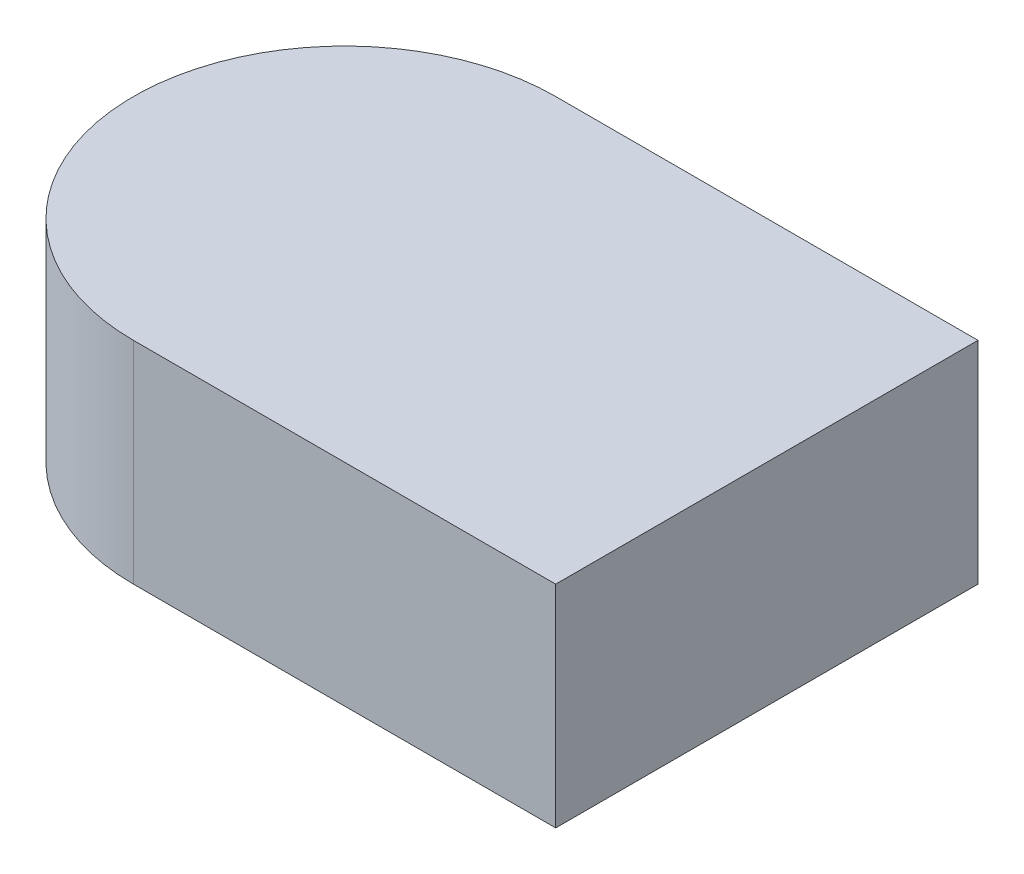
ISO-10303-21;
HEADER;
FILE_DESCRIPTION(('STEP AP214'),'2;1');
FILE_NAME('part.step','',(''),(''),'','','');
FILE_SCHEMA(('AUTOMOTIVE_DESIGN { 1 0 10303 214 1 1 1 1 }'));
ENDSEC;
DATA;
#1=APPLICATION_CONTEXT('core data for automotive mechanical design processes');
#2=APPLICATION_PROTOCOL_DEFINITION('international standard','automotive_design',2000,#1);
#3=PRODUCT_CONTEXT('',#1,'mechanical');
#4=PRODUCT('Part','Part','',(#3));
#5=PRODUCT_RELATED_PRODUCT_CATEGORY('part','',(#4));
#6=PRODUCT_DEFINITION_FORMATION('','',#4);
#7=PRODUCT_DEFINITION_CONTEXT('part definition',#1,'design');
#8=PRODUCT_DEFINITION('design','',#6,#7);
#9=PRODUCT_DEFINITION_SHAPE('','',#8);
#10=(LENGTH_UNIT() NAMED_UNIT(*) SI_UNIT(.MILLI.,.METRE.));
#11=(NAMED_UNIT(*) PLANE_ANGLE_UNIT() SI_UNIT($,.RADIAN.));
#12=(NAMED_UNIT(*) SI_UNIT($,.STERADIAN.) SOLID_ANGLE_UNIT());
#13=UNCERTAINTY_MEASURE_WITH_UNIT(LENGTH_MEASURE(1.E-05),#10,'distance_accuracy_value','');
#14=(GEOMETRIC_REPRESENTATION_CONTEXT(3) GLOBAL_UNCERTAINTY_ASSIGNED_CONTEXT((#13)) GLOBAL_UNIT_ASSIGNED_CONTEXT((#10,
#11,#12)) REPRESENTATION_CONTEXT('',''));
#15=CARTESIAN_POINT('',(0.,0.,0.));
#16=DIRECTION('',(0.,0.,1.));
#17=DIRECTION('',(1.,0.,0.));
#18=AXIS2_PLACEMENT_3D('',#15,#16,#17);
#19=CARTESIAN_POINT('',(0.,0.,0.));
#20=DIRECTION('',(0.,1.,0.));
#21=DIRECTION('',(1.,0.,0.));
#22=AXIS2_PLACEMENT_3D('',#19,#20,#21);
#23=PLANE('',#22);
#24=DIRECTION('',(0.,0.,-1.));
#25=VECTOR('',#24,1.);
#26=CARTESIAN_POINT('',(1.25,0.,1.5));
#27=LINE('',#26,#25);
#28=CARTESIAN_POINT('',(1.25,0.,1.5));
#29=VERTEX_POINT('',#28);
#30=CARTESIAN_POINT('',(1.25,0.,1.3));
#31=VERTEX_POINT('',#30);
#32=EDGE_CURVE('E11',#29,#31,#27,.T.);
#33=ORIENTED_EDGE('',*,*,#32,.F.);
#34=DIRECTION('',(1.,0.,0.));
#35=VECTOR('',#34,1.);
#36=CARTESIAN_POINT('',(1.05,0.,1.5));
#37=LINE('',#36,#35);
#38=CARTESIAN_POINT('',(1.05,0.,1.5));
#39=VERTEX_POINT('',#38);
#40=EDGE_CURVE('E25',#39,#29,#37,.T.);
#41=ORIENTED_EDGE('',*,*,#40,.F.);
#42=CARTESIAN_POINT('',(1.05,0.,1.4));
#43=DIRECTION('',(0.,1.,0.));
#44=DIRECTION('',(0.,0.,-1.));
#45=AXIS2_PLACEMENT_3D('',#42,#43,#44);
#46=CIRCLE('',#45,0.1);
#47=CARTESIAN_POINT('',(1.05,0.,1.3));
#48=VERTEX_POINT('',#47);
#49=EDGE_CURVE('E73',#48,#39,#46,.T.);
#50=ORIENTED_EDGE('',*,*,#49,.F.);
#51=DIRECTION('',(-1.,0.,0.));
#52=VECTOR('',#51,1.);
#53=CARTESIAN_POINT('',(1.25,0.,1.3));
#54=LINE('',#53,#52);
#55=EDGE_CURVE('E99',#31,#48,#54,.T.);
#56=ORIENTED_EDGE('',*,*,#55,.F.);
#57=EDGE_LOOP('',(#33,#41,#50,#56));
#58=FACE_BOUND('',#57,.T.);
#59=ADVANCED_FACE('F17',(#58),#23,.F.);
#60=CARTESIAN_POINT('',(1.25,0.,1.3));
#61=DIRECTION('',(0.,0.,-1.));
#62=DIRECTION('',(-1.,0.,0.));
#63=AXIS2_PLACEMENT_3D('',#60,#61,#62);
#64=PLANE('',#63);
#65=DIRECTION('',(0.,1.,0.));
#66=VECTOR('',#65,1.);
#67=CARTESIAN_POINT('',(1.05,0.,1.3));
#68=LINE('',#67,#66);
#69=CARTESIAN_POINT('',(1.05,0.1,1.3));
#70=VERTEX_POINT('',#69);
#71=EDGE_CURVE('E95',#48,#70,#68,.T.);
#72=ORIENTED_EDGE('',*,*,#71,.T.);
#73=DIRECTION('',(-1.,0.,0.));
#74=VECTOR('',#73,1.);
#75=CARTESIAN_POINT('',(1.25,0.1,1.3));
#76=LINE('',#75,#74);
#77=CARTESIAN_POINT('',(1.25,0.1,1.3));
#78=VERTEX_POINT('',#77);
#79=EDGE_CURVE('E68',#78,#70,#76,.T.);
#80=ORIENTED_EDGE('',*,*,#79,.F.);
#81=DIRECTION('',(0.,1.,0.));
#82=VECTOR('',#81,1.);
#83=CARTESIAN_POINT('',(1.25,0.,1.3));
#84=LINE('',#83,#82);
#85=EDGE_CURVE('E87',#31,#78,#84,.T.);
#86=ORIENTED_EDGE('',*,*,#85,.F.);
#87=ORIENTED_EDGE('',*,*,#55,.T.);
#88=EDGE_LOOP('',(#72,#80,#86,#87));
#89=FACE_BOUND('',#88,.T.);
#90=ADVANCED_FACE('F113',(#89),#64,.T.);
#91=CARTESIAN_POINT('',(1.25,0.,1.5));
#92=DIRECTION('',(1.,0.,0.));
#93=DIRECTION('',(0.,0.,-1.));
#94=AXIS2_PLACEMENT_3D('',#91,#92,#93);
#95=PLANE('',#94);
#96=ORIENTED_EDGE('',*,*,#85,.T.);
#97=DIRECTION('',(0.,0.,-1.));
#98=VECTOR('',#97,1.);
#99=CARTESIAN_POINT('',(1.25,0.1,1.5));
#100=LINE('',#99,#98);
#101=CARTESIAN_POINT('',(1.25,0.1,1.5));
#102=VERTEX_POINT('',#101);
#103=EDGE_CURVE('E83',#102,#78,#100,.T.);
#104=ORIENTED_EDGE('',*,*,#103,.F.);
#105=DIRECTION('',(0.,1.,0.));
#106=VECTOR('',#105,1.);
#107=CARTESIAN_POINT('',(1.25,0.,1.5));
#108=LINE('',#107,#106);
#109=EDGE_CURVE('E60',#29,#102,#108,.T.);
#110=ORIENTED_EDGE('',*,*,#109,.F.);
#111=ORIENTED_EDGE('',*,*,#32,.T.);
#112=EDGE_LOOP('',(#96,#104,#110,#111));
#113=FACE_BOUND('',#112,.T.);
#114=ADVANCED_FACE('F119',(#113),#95,.T.);
#115=CARTESIAN_POINT('',(1.05,0.,1.5));
#116=DIRECTION('',(0.,0.,1.));
#117=DIRECTION('',(1.,0.,0.));
#118=AXIS2_PLACEMENT_3D('',#115,#116,#117);
#119=PLANE('',#118);
#120=ORIENTED_EDGE('',*,*,#109,.T.);
#121=DIRECTION('',(1.,0.,0.));
#122=VECTOR('',#121,1.);
#123=CARTESIAN_POINT('',(1.05,0.1,1.5));
#124=LINE('',#123,#122);
#125=CARTESIAN_POINT('',(1.05,0.1,1.5));
#126=VERTEX_POINT('',#125);
#127=EDGE_CURVE('E54',#126,#102,#124,.T.);
#128=ORIENTED_EDGE('',*,*,#127,.F.);
#129=DIRECTION('',(0.,1.,0.));
#130=VECTOR('',#129,1.);
#131=CARTESIAN_POINT('',(1.05,0.,1.5));
#132=LINE('',#131,#130);
#133=EDGE_CURVE('E58',#39,#126,#132,.T.);
#134=ORIENTED_EDGE('',*,*,#133,.F.);
#135=ORIENTED_EDGE('',*,*,#40,.T.);
#136=EDGE_LOOP('',(#120,#128,#134,#135));
#137=FACE_BOUND('',#136,.T.);
#138=ADVANCED_FACE('F56',(#137),#119,.T.);
#139=CARTESIAN_POINT('',(1.05,0.,1.4));
#140=DIRECTION('',(0.,1.,0.));
#141=DIRECTION('',(1.,0.,0.));
#142=AXIS2_PLACEMENT_3D('',#139,#140,#141);
#143=CYLINDRICAL_SURFACE('',#142,0.1);
#144=ORIENTED_EDGE('',*,*,#133,.T.);
#145=CARTESIAN_POINT('',(1.05,0.1,1.4));
#146=DIRECTION('',(0.,1.,0.));
#147=DIRECTION('',(0.,0.,-1.));
#148=AXIS2_PLACEMENT_3D('',#145,#146,#147);
#149=CIRCLE('',#148,0.1);
#150=EDGE_CURVE('E66',#70,#126,#149,.T.);
#151=ORIENTED_EDGE('',*,*,#150,.F.);
#152=ORIENTED_EDGE('',*,*,#71,.F.);
#153=ORIENTED_EDGE('',*,*,#49,.T.);
#154=EDGE_LOOP('',(#144,#151,#152,#153));
#155=FACE_BOUND('',#154,.T.);
#156=ADVANCED_FACE('F72',(#155),#143,.T.);
#157=CARTESIAN_POINT('',(0.,0.1,0.));
#158=DIRECTION('',(0.,1.,0.));
#159=DIRECTION('',(1.,0.,0.));
#160=AXIS2_PLACEMENT_3D('',#157,#158,#159);
#161=PLANE('',#160);
#162=ORIENTED_EDGE('',*,*,#150,.T.);
#163=ORIENTED_EDGE('',*,*,#127,.T.);
#164=ORIENTED_EDGE('',*,*,#103,.T.);
#165=ORIENTED_EDGE('',*,*,#79,.T.);
#166=EDGE_LOOP('',(#162,#163,#164,#165));
#167=FACE_BOUND('',#166,.T.);
#168=ADVANCED_FACE('F67',(#167),#161,.T.);
#169=CLOSED_SHELL('',(#59,#90,#114,#138,#156,#168));
#170=MANIFOLD_SOLID_BREP('B1',#169);
#171=ADVANCED_BREP_SHAPE_REPRESENTATION('',(#18,#170),#14);
#172=SHAPE_DEFINITION_REPRESENTATION(#9,#171);
ENDSEC;
END-ISO-10303-21;
